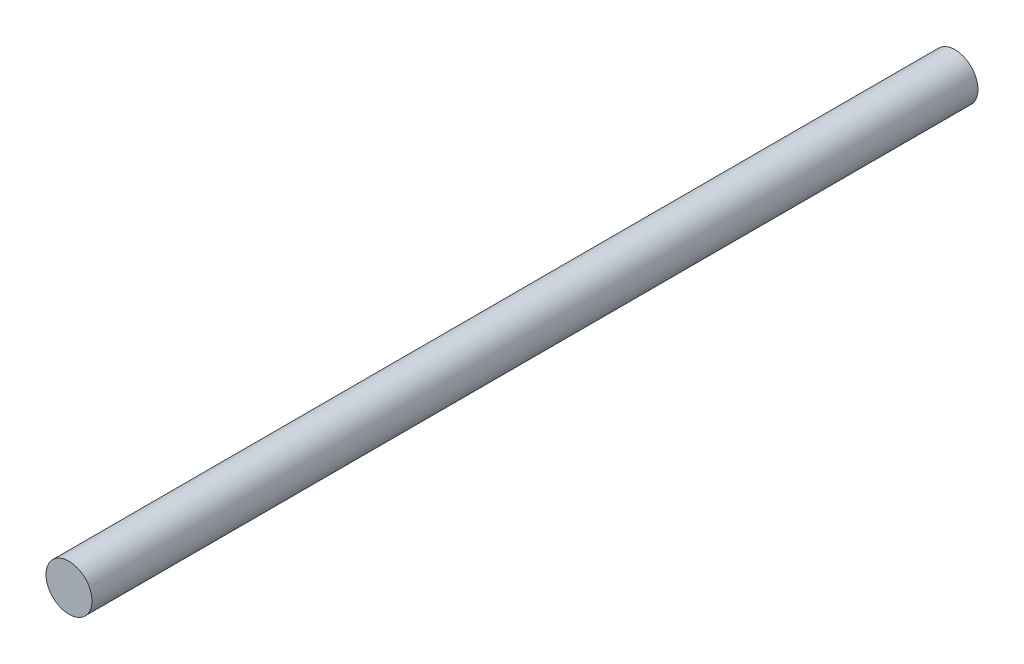
ISO-10303-21;
HEADER;
FILE_DESCRIPTION(('STEP AP214'),'2;1');
FILE_NAME('part.step','',(''),(''),'','','');
FILE_SCHEMA(('AUTOMOTIVE_DESIGN { 1 0 10303 214 1 1 1 1 }'));
ENDSEC;
DATA;
#1=APPLICATION_CONTEXT('core data for automotive mechanical design processes');
#2=APPLICATION_PROTOCOL_DEFINITION('international standard','automotive_design',2000,#1);
#3=PRODUCT_CONTEXT('',#1,'mechanical');
#4=PRODUCT('Part','Part','',(#3));
#5=PRODUCT_RELATED_PRODUCT_CATEGORY('part','',(#4));
#6=PRODUCT_DEFINITION_FORMATION('','',#4);
#7=PRODUCT_DEFINITION_CONTEXT('part definition',#1,'design');
#8=PRODUCT_DEFINITION('design','',#6,#7);
#9=PRODUCT_DEFINITION_SHAPE('','',#8);
#10=(LENGTH_UNIT() NAMED_UNIT(*) SI_UNIT(.MILLI.,.METRE.));
#11=(NAMED_UNIT(*) PLANE_ANGLE_UNIT() SI_UNIT($,.RADIAN.));
#12=(NAMED_UNIT(*) SI_UNIT($,.STERADIAN.) SOLID_ANGLE_UNIT());
#13=UNCERTAINTY_MEASURE_WITH_UNIT(LENGTH_MEASURE(1.E-05),#10,'distance_accuracy_value','');
#14=(GEOMETRIC_REPRESENTATION_CONTEXT(3) GLOBAL_UNCERTAINTY_ASSIGNED_CONTEXT((#13)) GLOBAL_UNIT_ASSIGNED_CONTEXT((#10,
#11,#12)) REPRESENTATION_CONTEXT('',''));
#15=CARTESIAN_POINT('',(0.,0.,0.));
#16=DIRECTION('',(0.,0.,1.));
#17=DIRECTION('',(1.,0.,0.));
#18=AXIS2_PLACEMENT_3D('',#15,#16,#17);
#19=CARTESIAN_POINT('',(0.,0.,154.));
#20=DIRECTION('',(0.,0.,-1.));
#21=DIRECTION('',(-1.,0.,0.));
#22=AXIS2_PLACEMENT_3D('',#19,#20,#21);
#23=CYLINDRICAL_SURFACE('',#22,4.);
#24=CARTESIAN_POINT('',(0.,0.,154.));
#25=DIRECTION('',(0.,0.,1.));
#26=DIRECTION('',(1.,0.,0.));
#27=AXIS2_PLACEMENT_3D('',#24,#25,#26);
#28=CIRCLE('',#27,4.);
#29=CARTESIAN_POINT('',(4.,0.,154.));
#30=VERTEX_POINT('',#29);
#31=EDGE_CURVE('E10',#30,#30,#28,.T.);
#32=ORIENTED_EDGE('',*,*,#31,.F.);
#33=EDGE_LOOP('',(#32));
#34=FACE_BOUND('',#33,.T.);
#35=CARTESIAN_POINT('',(0.,0.,0.));
#36=DIRECTION('',(0.,0.,1.));
#37=DIRECTION('',(1.,0.,0.));
#38=AXIS2_PLACEMENT_3D('',#35,#36,#37);
#39=CIRCLE('',#38,4.);
#40=CARTESIAN_POINT('',(4.,0.,0.));
#41=VERTEX_POINT('',#40);
#42=EDGE_CURVE('E33',#41,#41,#39,.T.);
#43=ORIENTED_EDGE('',*,*,#42,.T.);
#44=EDGE_LOOP('',(#43));
#45=FACE_BOUND('',#44,.T.);
#46=ADVANCED_FACE('F30',(#34,#45),#23,.T.);
#47=CARTESIAN_POINT('',(0.,0.,154.));
#48=DIRECTION('',(0.,0.,1.));
#49=DIRECTION('',(1.,0.,0.));
#50=AXIS2_PLACEMENT_3D('',#47,#48,#49);
#51=PLANE('',#50);
#52=ORIENTED_EDGE('',*,*,#31,.T.);
#53=EDGE_LOOP('',(#52));
#54=FACE_BOUND('',#53,.T.);
#55=ADVANCED_FACE('F45',(#54),#51,.T.);
#56=CARTESIAN_POINT('',(0.,0.,0.));
#57=DIRECTION('',(0.,0.,1.));
#58=DIRECTION('',(1.,0.,0.));
#59=AXIS2_PLACEMENT_3D('',#56,#57,#58);
#60=PLANE('',#59);
#61=ORIENTED_EDGE('',*,*,#42,.F.);
#62=EDGE_LOOP('',(#61));
#63=FACE_BOUND('',#62,.T.);
#64=ADVANCED_FACE('F43',(#63),#60,.F.);
#65=CLOSED_SHELL('',(#46,#55,#64));
#66=MANIFOLD_SOLID_BREP('B2',#65);
#67=ADVANCED_BREP_SHAPE_REPRESENTATION('',(#18,#66),#14);
#68=SHAPE_DEFINITION_REPRESENTATION(#9,#67);
ENDSEC;
END-ISO-10303-21;
